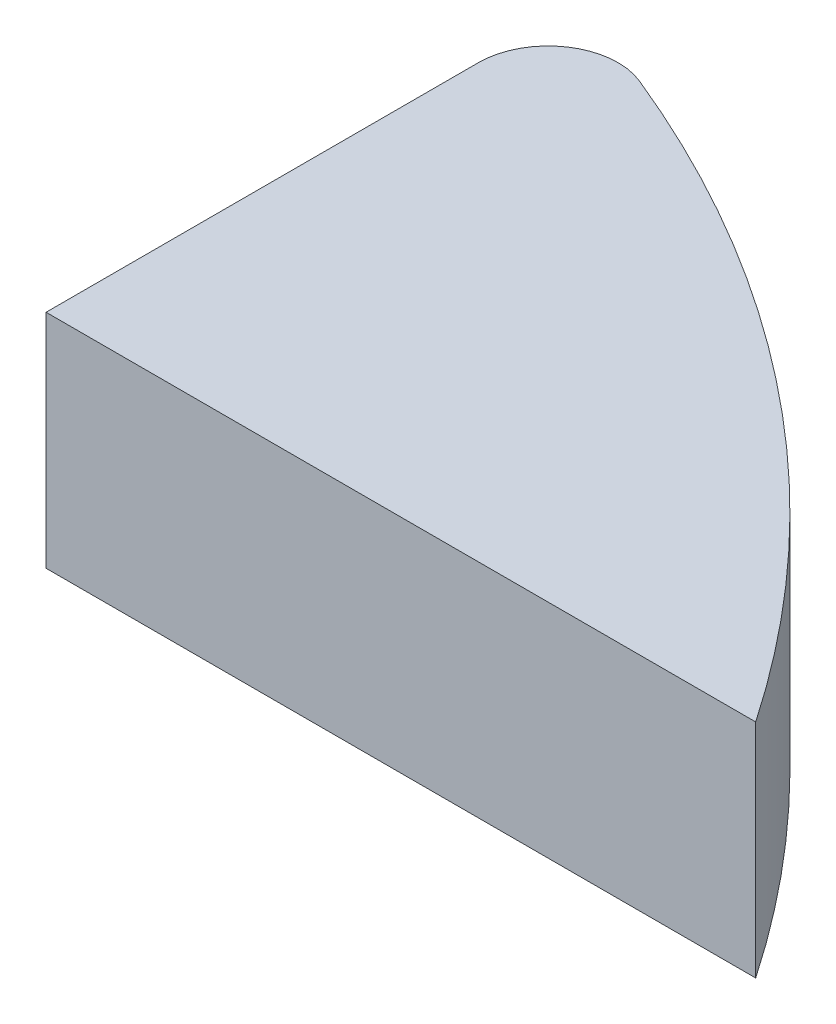
ISO-10303-21;
HEADER;
FILE_DESCRIPTION(('STEP AP214'),'2;1');
FILE_NAME('part.step','',(''),(''),'','','');
FILE_SCHEMA(('AUTOMOTIVE_DESIGN { 1 0 10303 214 1 1 1 1 }'));
ENDSEC;
DATA;
#1=APPLICATION_CONTEXT('core data for automotive mechanical design processes');
#2=APPLICATION_PROTOCOL_DEFINITION('international standard','automotive_design',2000,#1);
#3=PRODUCT_CONTEXT('',#1,'mechanical');
#4=PRODUCT('Part','Part','',(#3));
#5=PRODUCT_RELATED_PRODUCT_CATEGORY('part','',(#4));
#6=PRODUCT_DEFINITION_FORMATION('','',#4);
#7=PRODUCT_DEFINITION_CONTEXT('part definition',#1,'design');
#8=PRODUCT_DEFINITION('design','',#6,#7);
#9=PRODUCT_DEFINITION_SHAPE('','',#8);
#10=(LENGTH_UNIT() NAMED_UNIT(*) SI_UNIT(.MILLI.,.METRE.));
#11=(NAMED_UNIT(*) PLANE_ANGLE_UNIT() SI_UNIT($,.RADIAN.));
#12=(NAMED_UNIT(*) SI_UNIT($,.STERADIAN.) SOLID_ANGLE_UNIT());
#13=UNCERTAINTY_MEASURE_WITH_UNIT(LENGTH_MEASURE(1.E-05),#10,'distance_accuracy_value','');
#14=(GEOMETRIC_REPRESENTATION_CONTEXT(3) GLOBAL_UNCERTAINTY_ASSIGNED_CONTEXT((#13)) GLOBAL_UNIT_ASSIGNED_CONTEXT((#10,
#11,#12)) REPRESENTATION_CONTEXT('',''));
#15=CARTESIAN_POINT('',(0.,0.,0.));
#16=DIRECTION('',(0.,0.,1.));
#17=DIRECTION('',(1.,0.,0.));
#18=AXIS2_PLACEMENT_3D('',#15,#16,#17);
#19=CARTESIAN_POINT('',(0.,6.35,0.));
#20=DIRECTION('',(0.,0.,-1.));
#21=DIRECTION('',(-1.,0.,0.));
#22=AXIS2_PLACEMENT_3D('',#19,#20,#21);
#23=PLANE('',#22);
#24=DIRECTION('',(1.,0.,0.));
#25=VECTOR('',#24,1.);
#26=CARTESIAN_POINT('',(0.,0.,0.));
#27=LINE('',#26,#25);
#28=CARTESIAN_POINT('',(0.,0.,0.));
#29=VERTEX_POINT('',#28);
#30=CARTESIAN_POINT('',(20.32,0.,0.));
#31=VERTEX_POINT('',#30);
#32=EDGE_CURVE('E90',#29,#31,#27,.T.);
#33=ORIENTED_EDGE('',*,*,#32,.T.);
#34=DIRECTION('',(0.,-1.,0.));
#35=VECTOR('',#34,1.);
#36=CARTESIAN_POINT('',(20.32,6.35,0.));
#37=LINE('',#36,#35);
#38=CARTESIAN_POINT('',(20.32,6.35,0.));
#39=VERTEX_POINT('',#38);
#40=EDGE_CURVE('E74',#39,#31,#37,.T.);
#41=ORIENTED_EDGE('',*,*,#40,.F.);
#42=DIRECTION('',(1.,0.,0.));
#43=VECTOR('',#42,1.);
#44=CARTESIAN_POINT('',(0.,6.35,0.));
#45=LINE('',#44,#43);
#46=CARTESIAN_POINT('',(0.,6.35,0.));
#47=VERTEX_POINT('',#46);
#48=EDGE_CURVE('E79',#47,#39,#45,.T.);
#49=ORIENTED_EDGE('',*,*,#48,.F.);
#50=DIRECTION('',(0.,-1.,0.));
#51=VECTOR('',#50,1.);
#52=CARTESIAN_POINT('',(0.,6.35,0.));
#53=LINE('',#52,#51);
#54=EDGE_CURVE('E92',#47,#29,#53,.T.);
#55=ORIENTED_EDGE('',*,*,#54,.T.);
#56=EDGE_LOOP('',(#33,#41,#49,#55));
#57=FACE_BOUND('',#56,.T.);
#58=ADVANCED_FACE('F33',(#57),#23,.F.);
#59=CARTESIAN_POINT('',(-12.0545100251372,6.35,21.999346700183));
#60=DIRECTION('',(0.,-1.,0.));
#61=DIRECTION('',(0.,0.,-1.));
#62=AXIS2_PLACEMENT_3D('',#59,#60,#61);
#63=CYLINDRICAL_SURFACE('',#62,39.1417954953853);
#64=CARTESIAN_POINT('',(-12.0545100251372,0.,21.999346700183));
#65=DIRECTION('',(0.,1.,0.));
#66=DIRECTION('',(0.,0.,-1.));
#67=AXIS2_PLACEMENT_3D('',#64,#65,#66);
#68=CIRCLE('',#67,39.1417954953853);
#69=CARTESIAN_POINT('',(2.75680294060547,0.,-14.231926570755));
#70=VERTEX_POINT('',#69);
#71=EDGE_CURVE('E100',#31,#70,#68,.T.);
#72=ORIENTED_EDGE('',*,*,#71,.T.);
#73=DIRECTION('',(0.,-1.,0.));
#74=VECTOR('',#73,1.);
#75=CARTESIAN_POINT('',(2.75680294060547,6.35,-14.231926570755));
#76=LINE('',#75,#74);
#77=CARTESIAN_POINT('',(2.75680294060547,6.35,-14.231926570755));
#78=VERTEX_POINT('',#77);
#79=EDGE_CURVE('E41',#70,#78,#76,.F.);
#80=ORIENTED_EDGE('',*,*,#79,.T.);
#81=CARTESIAN_POINT('',(-12.0545100251372,6.35,21.999346700183));
#82=DIRECTION('',(0.,1.,0.));
#83=DIRECTION('',(0.,0.,-1.));
#84=AXIS2_PLACEMENT_3D('',#81,#82,#83);
#85=CIRCLE('',#84,39.1417954953853);
#86=EDGE_CURVE('E70',#39,#78,#85,.T.);
#87=ORIENTED_EDGE('',*,*,#86,.F.);
#88=ORIENTED_EDGE('',*,*,#40,.T.);
#89=EDGE_LOOP('',(#72,#80,#87,#88));
#90=FACE_BOUND('',#89,.T.);
#91=ADVANCED_FACE('F72',(#90),#63,.T.);
#92=CARTESIAN_POINT('',(0.,6.35,0.));
#93=DIRECTION('',(1.,0.,0.));
#94=DIRECTION('',(0.,0.,-1.));
#95=AXIS2_PLACEMENT_3D('',#92,#93,#94);
#96=PLANE('',#95);
#97=DIRECTION('',(0.,0.,1.));
#98=VECTOR('',#97,1.);
#99=CARTESIAN_POINT('',(0.,6.35,0.));
#100=LINE('',#99,#98);
#101=CARTESIAN_POINT('',(0.,6.35,-12.3806434186978));
#102=VERTEX_POINT('',#101);
#103=EDGE_CURVE('E78',#102,#47,#100,.T.);
#104=ORIENTED_EDGE('',*,*,#103,.F.);
#105=DIRECTION('',(0.,-1.,0.));
#106=VECTOR('',#105,1.);
#107=CARTESIAN_POINT('',(0.,6.35,-12.3806434186978));
#108=LINE('',#107,#106);
#109=CARTESIAN_POINT('',(0.,0.,-12.3806434186978));
#110=VERTEX_POINT('',#109);
#111=EDGE_CURVE('E91',#102,#110,#108,.T.);
#112=ORIENTED_EDGE('',*,*,#111,.T.);
#113=DIRECTION('',(0.,0.,1.));
#114=VECTOR('',#113,1.);
#115=CARTESIAN_POINT('',(0.,0.,0.));
#116=LINE('',#115,#114);
#117=EDGE_CURVE('E87',#110,#29,#116,.T.);
#118=ORIENTED_EDGE('',*,*,#117,.T.);
#119=ORIENTED_EDGE('',*,*,#54,.F.);
#120=EDGE_LOOP('',(#104,#112,#118,#119));
#121=FACE_BOUND('',#120,.T.);
#122=ADVANCED_FACE('F106',(#121),#96,.F.);
#123=CARTESIAN_POINT('',(-12.0545100251372,6.35,21.999346700183));
#124=DIRECTION('',(0.,-1.,0.));
#125=DIRECTION('',(0.,0.,-1.));
#126=AXIS2_PLACEMENT_3D('',#123,#124,#125);
#127=PLANE('',#126);
#128=ORIENTED_EDGE('',*,*,#86,.T.);
#129=CARTESIAN_POINT('',(2.,6.35,-12.3806434186978));
#130=DIRECTION('',(0.,-1.,0.));
#131=DIRECTION('',(0.,0.,-1.));
#132=AXIS2_PLACEMENT_3D('',#129,#130,#131);
#133=CIRCLE('',#132,2.);
#134=EDGE_CURVE('E11',#78,#102,#133,.F.);
#135=ORIENTED_EDGE('',*,*,#134,.T.);
#136=ORIENTED_EDGE('',*,*,#103,.T.);
#137=ORIENTED_EDGE('',*,*,#48,.T.);
#138=EDGE_LOOP('',(#128,#135,#136,#137));
#139=FACE_BOUND('',#138,.T.);
#140=ADVANCED_FACE('F82',(#139),#127,.F.);
#141=CARTESIAN_POINT('',(-12.0545100251372,0.,21.999346700183));
#142=DIRECTION('',(0.,-1.,0.));
#143=DIRECTION('',(0.,0.,-1.));
#144=AXIS2_PLACEMENT_3D('',#141,#142,#143);
#145=PLANE('',#144);
#146=ORIENTED_EDGE('',*,*,#117,.F.);
#147=CARTESIAN_POINT('',(2.,0.,-12.3806434186978));
#148=DIRECTION('',(0.,-1.,0.));
#149=DIRECTION('',(0.,0.,-1.));
#150=AXIS2_PLACEMENT_3D('',#147,#148,#149);
#151=CIRCLE('',#150,2.);
#152=EDGE_CURVE('E55',#110,#70,#151,.T.);
#153=ORIENTED_EDGE('',*,*,#152,.T.);
#154=ORIENTED_EDGE('',*,*,#71,.F.);
#155=ORIENTED_EDGE('',*,*,#32,.F.);
#156=EDGE_LOOP('',(#146,#153,#154,#155));
#157=FACE_BOUND('',#156,.T.);
#158=ADVANCED_FACE('F107',(#157),#145,.T.);
#159=CARTESIAN_POINT('',(2.,6.35,-12.3806434186978));
#160=DIRECTION('',(0.,-1.,0.));
#161=DIRECTION('',(0.,0.,-1.));
#162=AXIS2_PLACEMENT_3D('',#159,#160,#161);
#163=CYLINDRICAL_SURFACE('',#162,2.);
#164=ORIENTED_EDGE('',*,*,#134,.F.);
#165=ORIENTED_EDGE('',*,*,#79,.F.);
#166=ORIENTED_EDGE('',*,*,#152,.F.);
#167=ORIENTED_EDGE('',*,*,#111,.F.);
#168=EDGE_LOOP('',(#164,#165,#166,#167));
#169=FACE_BOUND('',#168,.T.);
#170=ADVANCED_FACE('F35',(#169),#163,.T.);
#171=CLOSED_SHELL('',(#58,#91,#122,#140,#158,#170));
#172=MANIFOLD_SOLID_BREP('B2',#171);
#173=ADVANCED_BREP_SHAPE_REPRESENTATION('',(#18,#172),#14);
#174=SHAPE_DEFINITION_REPRESENTATION(#9,#173);
ENDSEC;
END-ISO-10303-21;
